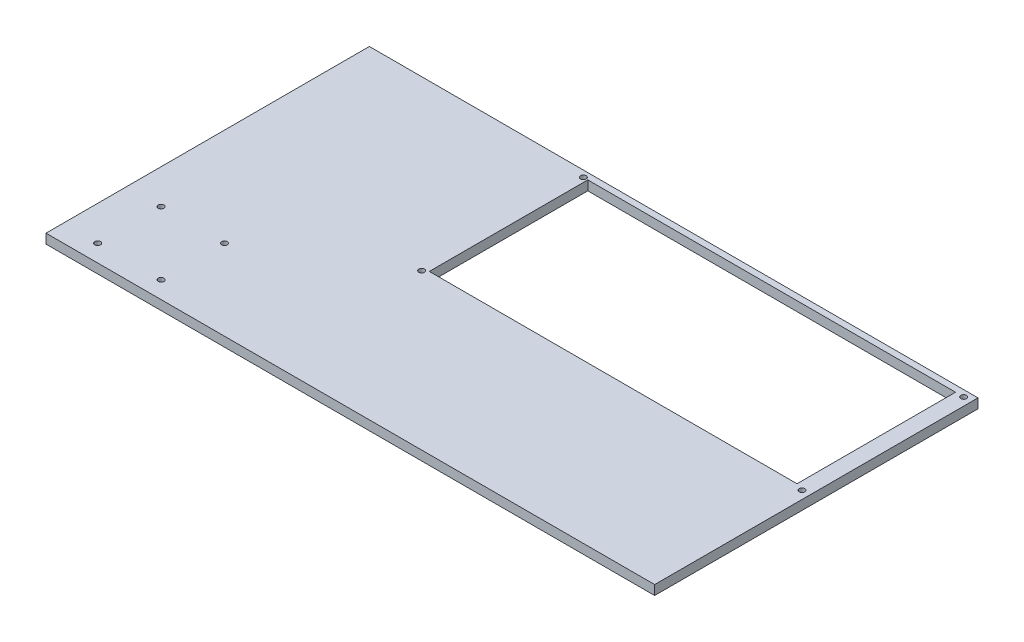
ISO-10303-21;
HEADER;
FILE_DESCRIPTION(('STEP AP214'),'2;1');
FILE_NAME('part.step','',(''),(''),'','','');
FILE_SCHEMA(('AUTOMOTIVE_DESIGN { 1 0 10303 214 1 1 1 1 }'));
ENDSEC;
DATA;
#1=APPLICATION_CONTEXT('core data for automotive mechanical design processes');
#2=APPLICATION_PROTOCOL_DEFINITION('international standard','automotive_design',2000,#1);
#3=PRODUCT_CONTEXT('',#1,'mechanical');
#4=PRODUCT('Part','Part','',(#3));
#5=PRODUCT_RELATED_PRODUCT_CATEGORY('part','',(#4));
#6=PRODUCT_DEFINITION_FORMATION('','',#4);
#7=PRODUCT_DEFINITION_CONTEXT('part definition',#1,'design');
#8=PRODUCT_DEFINITION('design','',#6,#7);
#9=PRODUCT_DEFINITION_SHAPE('','',#8);
#10=(LENGTH_UNIT() NAMED_UNIT(*) SI_UNIT(.MILLI.,.METRE.));
#11=(NAMED_UNIT(*) PLANE_ANGLE_UNIT() SI_UNIT($,.RADIAN.));
#12=(NAMED_UNIT(*) SI_UNIT($,.STERADIAN.) SOLID_ANGLE_UNIT());
#13=UNCERTAINTY_MEASURE_WITH_UNIT(LENGTH_MEASURE(1.E-05),#10,'distance_accuracy_value','');
#14=(GEOMETRIC_REPRESENTATION_CONTEXT(3) GLOBAL_UNCERTAINTY_ASSIGNED_CONTEXT((#13)) GLOBAL_UNIT_ASSIGNED_CONTEXT((#10,
#11,#12)) REPRESENTATION_CONTEXT('',''));
#15=CARTESIAN_POINT('',(0.,0.,0.));
#16=DIRECTION('',(0.,0.,1.));
#17=DIRECTION('',(1.,0.,0.));
#18=AXIS2_PLACEMENT_3D('',#15,#16,#17);
#19=CARTESIAN_POINT('',(-480.,7.50000000000006,255.));
#20=DIRECTION('',(1.,0.,0.));
#21=DIRECTION('',(0.,0.,-1.));
#22=AXIS2_PLACEMENT_3D('',#19,#20,#21);
#23=PLANE('',#22);
#24=DIRECTION('',(0.,0.,1.));
#25=VECTOR('',#24,1.);
#26=CARTESIAN_POINT('',(-480.,-7.49999999999995,255.));
#27=LINE('',#26,#25);
#28=CARTESIAN_POINT('',(-480.,-7.49999999999984,-255.));
#29=VERTEX_POINT('',#28);
#30=CARTESIAN_POINT('',(-480.,-7.49999999999995,255.));
#31=VERTEX_POINT('',#30);
#32=EDGE_CURVE('E135',#29,#31,#27,.T.);
#33=ORIENTED_EDGE('',*,*,#32,.T.);
#34=DIRECTION('',(0.,-1.,0.));
#35=VECTOR('',#34,1.);
#36=CARTESIAN_POINT('',(-480.,7.50000000000006,255.));
#37=LINE('',#36,#35);
#38=CARTESIAN_POINT('',(-480.,7.50000000000006,255.));
#39=VERTEX_POINT('',#38);
#40=EDGE_CURVE('E11',#39,#31,#37,.T.);
#41=ORIENTED_EDGE('',*,*,#40,.F.);
#42=DIRECTION('',(0.,0.,1.));
#43=VECTOR('',#42,1.);
#44=CARTESIAN_POINT('',(-480.,7.50000000000006,255.));
#45=LINE('',#44,#43);
#46=CARTESIAN_POINT('',(-480.,7.50000000000006,-255.));
#47=VERTEX_POINT('',#46);
#48=EDGE_CURVE('E139',#47,#39,#45,.T.);
#49=ORIENTED_EDGE('',*,*,#48,.F.);
#50=DIRECTION('',(0.,-1.,0.));
#51=VECTOR('',#50,1.);
#52=CARTESIAN_POINT('',(-480.,7.50000000000006,-255.));
#53=LINE('',#52,#51);
#54=EDGE_CURVE('E149',#47,#29,#53,.T.);
#55=ORIENTED_EDGE('',*,*,#54,.T.);
#56=EDGE_LOOP('',(#33,#41,#49,#55));
#57=FACE_BOUND('',#56,.T.);
#58=ADVANCED_FACE('F34',(#57),#23,.F.);
#59=CARTESIAN_POINT('',(480.,7.49999999999995,255.));
#60=DIRECTION('',(0.,0.,-1.));
#61=DIRECTION('',(-1.,0.,0.));
#62=AXIS2_PLACEMENT_3D('',#59,#60,#61);
#63=PLANE('',#62);
#64=DIRECTION('',(1.,0.,0.));
#65=VECTOR('',#64,1.);
#66=CARTESIAN_POINT('',(480.,-7.49999999999995,255.));
#67=LINE('',#66,#65);
#68=CARTESIAN_POINT('',(480.,-7.49999999999995,255.));
#69=VERTEX_POINT('',#68);
#70=EDGE_CURVE('E152',#31,#69,#67,.T.);
#71=ORIENTED_EDGE('',*,*,#70,.T.);
#72=DIRECTION('',(0.,-1.,0.));
#73=VECTOR('',#72,1.);
#74=CARTESIAN_POINT('',(480.,7.49999999999995,255.));
#75=LINE('',#74,#73);
#76=CARTESIAN_POINT('',(480.,7.49999999999995,255.));
#77=VERTEX_POINT('',#76);
#78=EDGE_CURVE('E41',#77,#69,#75,.T.);
#79=ORIENTED_EDGE('',*,*,#78,.F.);
#80=DIRECTION('',(1.,0.,0.));
#81=VECTOR('',#80,1.);
#82=CARTESIAN_POINT('',(480.,7.49999999999995,255.));
#83=LINE('',#82,#81);
#84=EDGE_CURVE('E142',#39,#77,#83,.T.);
#85=ORIENTED_EDGE('',*,*,#84,.F.);
#86=ORIENTED_EDGE('',*,*,#40,.T.);
#87=EDGE_LOOP('',(#71,#79,#85,#86));
#88=FACE_BOUND('',#87,.T.);
#89=ADVANCED_FACE('F180',(#88),#63,.F.);
#90=CARTESIAN_POINT('',(480.,7.49999999999995,255.));
#91=DIRECTION('',(-1.,0.,0.));
#92=DIRECTION('',(0.,0.,1.));
#93=AXIS2_PLACEMENT_3D('',#90,#91,#92);
#94=PLANE('',#93);
#95=DIRECTION('',(0.,0.,-1.));
#96=VECTOR('',#95,1.);
#97=CARTESIAN_POINT('',(480.,-7.49999999999995,255.));
#98=LINE('',#97,#96);
#99=CARTESIAN_POINT('',(480.,-7.49999999999995,-255.));
#100=VERTEX_POINT('',#99);
#101=EDGE_CURVE('E154',#69,#100,#98,.T.);
#102=ORIENTED_EDGE('',*,*,#101,.T.);
#103=DIRECTION('',(0.,-1.,0.));
#104=VECTOR('',#103,1.);
#105=CARTESIAN_POINT('',(480.,7.50000000000006,-255.));
#106=LINE('',#105,#104);
#107=CARTESIAN_POINT('',(480.,7.50000000000006,-255.));
#108=VERTEX_POINT('',#107);
#109=EDGE_CURVE('E159',#108,#100,#106,.T.);
#110=ORIENTED_EDGE('',*,*,#109,.F.);
#111=DIRECTION('',(0.,0.,-1.));
#112=VECTOR('',#111,1.);
#113=CARTESIAN_POINT('',(480.,7.49999999999995,255.));
#114=LINE('',#113,#112);
#115=EDGE_CURVE('E145',#77,#108,#114,.T.);
#116=ORIENTED_EDGE('',*,*,#115,.F.);
#117=ORIENTED_EDGE('',*,*,#78,.T.);
#118=EDGE_LOOP('',(#102,#110,#116,#117));
#119=FACE_BOUND('',#118,.T.);
#120=ADVANCED_FACE('F166',(#119),#94,.F.);
#121=CARTESIAN_POINT('',(480.,7.50000000000006,-255.));
#122=DIRECTION('',(0.,0.,1.));
#123=DIRECTION('',(1.,0.,0.));
#124=AXIS2_PLACEMENT_3D('',#121,#122,#123);
#125=PLANE('',#124);
#126=DIRECTION('',(-1.,0.,0.));
#127=VECTOR('',#126,1.);
#128=CARTESIAN_POINT('',(480.,-7.49999999999995,-255.));
#129=LINE('',#128,#127);
#130=EDGE_CURVE('E143',#100,#29,#129,.T.);
#131=ORIENTED_EDGE('',*,*,#130,.T.);
#132=ORIENTED_EDGE('',*,*,#54,.F.);
#133=DIRECTION('',(-1.,0.,0.));
#134=VECTOR('',#133,1.);
#135=CARTESIAN_POINT('',(480.,7.50000000000006,-255.));
#136=LINE('',#135,#134);
#137=EDGE_CURVE('E147',#108,#47,#136,.T.);
#138=ORIENTED_EDGE('',*,*,#137,.F.);
#139=ORIENTED_EDGE('',*,*,#109,.T.);
#140=EDGE_LOOP('',(#131,#132,#138,#139));
#141=FACE_BOUND('',#140,.T.);
#142=ADVANCED_FACE('F173',(#141),#125,.F.);
#143=CARTESIAN_POINT('',(0.,7.49999999999995,0.));
#144=DIRECTION('',(0.,1.,0.));
#145=DIRECTION('',(0.,0.,1.));
#146=AXIS2_PLACEMENT_3D('',#143,#144,#145);
#147=PLANE('',#146);
#148=CARTESIAN_POINT('',(-132.5,7.49999999999995,10.0000000000007));
#149=DIRECTION('',(0.,-1.,0.));
#150=DIRECTION('',(0.,0.,-1.));
#151=AXIS2_PLACEMENT_3D('',#148,#149,#150);
#152=CIRCLE('',#151,4.49999999999999);
#153=CARTESIAN_POINT('',(-132.5,7.49999999999995,5.50000000000068));
#154=VERTEX_POINT('',#153);
#155=EDGE_CURVE('E271',#154,#154,#152,.T.);
#156=ORIENTED_EDGE('',*,*,#155,.T.);
#157=EDGE_LOOP('',(#156));
#158=FACE_BOUND('',#157,.T.);
#159=CARTESIAN_POINT('',(-325.5,7.50000000000006,228.));
#160=DIRECTION('',(0.,-1.,0.));
#161=DIRECTION('',(0.,0.,-1.));
#162=AXIS2_PLACEMENT_3D('',#159,#160,#161);
#163=CIRCLE('',#162,4.50000000000002);
#164=CARTESIAN_POINT('',(-325.5,7.50000000000006,223.5));
#165=VERTEX_POINT('',#164);
#166=EDGE_CURVE('E264',#165,#165,#163,.T.);
#167=ORIENTED_EDGE('',*,*,#166,.T.);
#168=EDGE_LOOP('',(#167));
#169=FACE_BOUND('',#168,.T.);
#170=CARTESIAN_POINT('',(-325.5,7.49999999999995,128.));
#171=DIRECTION('',(0.,-1.,0.));
#172=DIRECTION('',(0.,0.,-1.));
#173=AXIS2_PLACEMENT_3D('',#170,#171,#172);
#174=CIRCLE('',#173,4.50000000000002);
#175=CARTESIAN_POINT('',(-325.5,7.49999999999995,123.5));
#176=VERTEX_POINT('',#175);
#177=EDGE_CURVE('E282',#176,#176,#174,.T.);
#178=ORIENTED_EDGE('',*,*,#177,.T.);
#179=EDGE_LOOP('',(#178));
#180=FACE_BOUND('',#179,.T.);
#181=CARTESIAN_POINT('',(-425.5,7.50000000000006,128.));
#182=DIRECTION('',(0.,-1.,0.));
#183=DIRECTION('',(0.,0.,-1.));
#184=AXIS2_PLACEMENT_3D('',#181,#182,#183);
#185=CIRCLE('',#184,4.50000000000002);
#186=CARTESIAN_POINT('',(-425.5,7.50000000000006,123.5));
#187=VERTEX_POINT('',#186);
#188=EDGE_CURVE('E276',#187,#187,#185,.T.);
#189=ORIENTED_EDGE('',*,*,#188,.T.);
#190=EDGE_LOOP('',(#189));
#191=FACE_BOUND('',#190,.T.);
#192=CARTESIAN_POINT('',(-132.5,7.49999999999995,-244.999999999999));
#193=DIRECTION('',(0.,-1.,0.));
#194=DIRECTION('',(0.,0.,-1.));
#195=AXIS2_PLACEMENT_3D('',#192,#193,#194);
#196=CIRCLE('',#195,4.50000000000004);
#197=CARTESIAN_POINT('',(-132.5,7.49999999999995,-249.499999999999));
#198=VERTEX_POINT('',#197);
#199=EDGE_CURVE('E243',#198,#198,#196,.T.);
#200=ORIENTED_EDGE('',*,*,#199,.T.);
#201=EDGE_LOOP('',(#200));
#202=FACE_BOUND('',#201,.T.);
#203=CARTESIAN_POINT('',(467.5,7.49999999999995,-244.999999999999));
#204=DIRECTION('',(0.,-1.,0.));
#205=DIRECTION('',(0.,0.,-1.));
#206=AXIS2_PLACEMENT_3D('',#203,#204,#205);
#207=CIRCLE('',#206,4.50000000000002);
#208=CARTESIAN_POINT('',(467.5,7.49999999999995,-249.499999999999));
#209=VERTEX_POINT('',#208);
#210=EDGE_CURVE('E248',#209,#209,#207,.T.);
#211=ORIENTED_EDGE('',*,*,#210,.T.);
#212=EDGE_LOOP('',(#211));
#213=FACE_BOUND('',#212,.T.);
#214=CARTESIAN_POINT('',(467.5,7.49999999999995,10.0000000000007));
#215=DIRECTION('',(0.,-1.,0.));
#216=DIRECTION('',(0.,0.,-1.));
#217=AXIS2_PLACEMENT_3D('',#214,#215,#216);
#218=CIRCLE('',#217,4.49999999999999);
#219=CARTESIAN_POINT('',(467.5,7.49999999999995,5.50000000000072));
#220=VERTEX_POINT('',#219);
#221=EDGE_CURVE('E258',#220,#220,#218,.T.);
#222=ORIENTED_EDGE('',*,*,#221,.T.);
#223=EDGE_LOOP('',(#222));
#224=FACE_BOUND('',#223,.T.);
#225=CARTESIAN_POINT('',(-425.5,7.50000000000006,228.));
#226=DIRECTION('',(0.,-1.,0.));
#227=DIRECTION('',(0.,0.,-1.));
#228=AXIS2_PLACEMENT_3D('',#225,#226,#227);
#229=CIRCLE('',#228,4.50000000000004);
#230=CARTESIAN_POINT('',(-425.5,7.50000000000006,223.5));
#231=VERTEX_POINT('',#230);
#232=EDGE_CURVE('E129',#231,#231,#229,.T.);
#233=ORIENTED_EDGE('',*,*,#232,.T.);
#234=EDGE_LOOP('',(#233));
#235=FACE_BOUND('',#234,.T.);
#236=DIRECTION('',(0.,0.,-1.));
#237=VECTOR('',#236,1.);
#238=CARTESIAN_POINT('',(454.54751,7.49999999999995,-245.));
#239=LINE('',#238,#237);
#240=CARTESIAN_POINT('',(454.54751,7.49999999999995,4.99999999999992));
#241=VERTEX_POINT('',#240);
#242=CARTESIAN_POINT('',(454.54751,7.49999999999995,-245.));
#243=VERTEX_POINT('',#242);
#244=EDGE_CURVE('E48',#241,#243,#239,.T.);
#245=ORIENTED_EDGE('',*,*,#244,.F.);
#246=DIRECTION('',(1.,0.,0.));
#247=VECTOR('',#246,1.);
#248=CARTESIAN_POINT('',(454.54751,7.49999999999995,4.99999999999992));
#249=LINE('',#248,#247);
#250=CARTESIAN_POINT('',(-125.45249,7.49999999999995,5.));
#251=VERTEX_POINT('',#250);
#252=EDGE_CURVE('E116',#251,#241,#249,.T.);
#253=ORIENTED_EDGE('',*,*,#252,.F.);
#254=DIRECTION('',(0.,0.,1.));
#255=VECTOR('',#254,1.);
#256=CARTESIAN_POINT('',(-125.45249,7.49999999999995,-245.));
#257=LINE('',#256,#255);
#258=CARTESIAN_POINT('',(-125.45249,7.49999999999995,-245.));
#259=VERTEX_POINT('',#258);
#260=EDGE_CURVE('E119',#259,#251,#257,.T.);
#261=ORIENTED_EDGE('',*,*,#260,.F.);
#262=DIRECTION('',(-1.,0.,0.));
#263=VECTOR('',#262,1.);
#264=CARTESIAN_POINT('',(454.54751,7.49999999999995,-245.));
#265=LINE('',#264,#263);
#266=EDGE_CURVE('E128',#243,#259,#265,.T.);
#267=ORIENTED_EDGE('',*,*,#266,.F.);
#268=EDGE_LOOP('',(#245,#253,#261,#267));
#269=FACE_BOUND('',#268,.T.);
#270=ORIENTED_EDGE('',*,*,#48,.T.);
#271=ORIENTED_EDGE('',*,*,#84,.T.);
#272=ORIENTED_EDGE('',*,*,#115,.T.);
#273=ORIENTED_EDGE('',*,*,#137,.T.);
#274=EDGE_LOOP('',(#270,#271,#272,#273));
#275=FACE_BOUND('',#274,.T.);
#276=ADVANCED_FACE('F179',(#158,#169,#180,#191,#202,#213,#224,#235,#269,#275),#147,.T.);
#277=CARTESIAN_POINT('',(0.,-7.49999999999995,0.));
#278=DIRECTION('',(0.,1.,0.));
#279=DIRECTION('',(0.,0.,1.));
#280=AXIS2_PLACEMENT_3D('',#277,#278,#279);
#281=PLANE('',#280);
#282=CARTESIAN_POINT('',(-132.5,-7.50000000000006,10.0000000000007));
#283=DIRECTION('',(0.,-1.,0.));
#284=DIRECTION('',(0.,0.,-1.));
#285=AXIS2_PLACEMENT_3D('',#282,#283,#284);
#286=CIRCLE('',#285,4.49999999999999);
#287=CARTESIAN_POINT('',(-132.5,-7.50000000000006,5.50000000000068));
#288=VERTEX_POINT('',#287);
#289=EDGE_CURVE('E250',#288,#288,#286,.T.);
#290=ORIENTED_EDGE('',*,*,#289,.F.);
#291=EDGE_LOOP('',(#290));
#292=FACE_BOUND('',#291,.T.);
#293=CARTESIAN_POINT('',(-325.5,-7.49999999999995,228.));
#294=DIRECTION('',(0.,-1.,0.));
#295=DIRECTION('',(0.,0.,-1.));
#296=AXIS2_PLACEMENT_3D('',#293,#294,#295);
#297=CIRCLE('',#296,4.50000000000002);
#298=CARTESIAN_POINT('',(-325.5,-7.49999999999995,223.5));
#299=VERTEX_POINT('',#298);
#300=EDGE_CURVE('E268',#299,#299,#297,.T.);
#301=ORIENTED_EDGE('',*,*,#300,.F.);
#302=EDGE_LOOP('',(#301));
#303=FACE_BOUND('',#302,.T.);
#304=CARTESIAN_POINT('',(-325.5,-7.49999999999995,128.));
#305=DIRECTION('',(0.,-1.,0.));
#306=DIRECTION('',(0.,0.,-1.));
#307=AXIS2_PLACEMENT_3D('',#304,#305,#306);
#308=CIRCLE('',#307,4.50000000000002);
#309=CARTESIAN_POINT('',(-325.5,-7.49999999999995,123.5));
#310=VERTEX_POINT('',#309);
#311=EDGE_CURVE('E267',#310,#310,#308,.T.);
#312=ORIENTED_EDGE('',*,*,#311,.F.);
#313=EDGE_LOOP('',(#312));
#314=FACE_BOUND('',#313,.T.);
#315=CARTESIAN_POINT('',(-425.5,-7.49999999999995,128.));
#316=DIRECTION('',(0.,-1.,0.));
#317=DIRECTION('',(0.,0.,-1.));
#318=AXIS2_PLACEMENT_3D('',#315,#316,#317);
#319=CIRCLE('',#318,4.50000000000002);
#320=CARTESIAN_POINT('',(-425.5,-7.49999999999995,123.5));
#321=VERTEX_POINT('',#320);
#322=EDGE_CURVE('E279',#321,#321,#319,.T.);
#323=ORIENTED_EDGE('',*,*,#322,.F.);
#324=EDGE_LOOP('',(#323));
#325=FACE_BOUND('',#324,.T.);
#326=CARTESIAN_POINT('',(-132.5,-7.50000000000006,-244.999999999999));
#327=DIRECTION('',(0.,-1.,0.));
#328=DIRECTION('',(0.,0.,-1.));
#329=AXIS2_PLACEMENT_3D('',#326,#327,#328);
#330=CIRCLE('',#329,4.50000000000004);
#331=CARTESIAN_POINT('',(-132.5,-7.50000000000006,-249.499999999999));
#332=VERTEX_POINT('',#331);
#333=EDGE_CURVE('E246',#332,#332,#330,.T.);
#334=ORIENTED_EDGE('',*,*,#333,.F.);
#335=EDGE_LOOP('',(#334));
#336=FACE_BOUND('',#335,.T.);
#337=CARTESIAN_POINT('',(467.5,-7.50000000000006,-244.999999999999));
#338=DIRECTION('',(0.,-1.,0.));
#339=DIRECTION('',(0.,0.,-1.));
#340=AXIS2_PLACEMENT_3D('',#337,#338,#339);
#341=CIRCLE('',#340,4.50000000000002);
#342=CARTESIAN_POINT('',(467.5,-7.50000000000006,-249.499999999999));
#343=VERTEX_POINT('',#342);
#344=EDGE_CURVE('E253',#343,#343,#341,.T.);
#345=ORIENTED_EDGE('',*,*,#344,.F.);
#346=EDGE_LOOP('',(#345));
#347=FACE_BOUND('',#346,.T.);
#348=CARTESIAN_POINT('',(467.5,-7.50000000000006,10.0000000000007));
#349=DIRECTION('',(0.,-1.,0.));
#350=DIRECTION('',(0.,0.,-1.));
#351=AXIS2_PLACEMENT_3D('',#348,#349,#350);
#352=CIRCLE('',#351,4.49999999999999);
#353=CARTESIAN_POINT('',(467.5,-7.50000000000006,5.50000000000072));
#354=VERTEX_POINT('',#353);
#355=EDGE_CURVE('E261',#354,#354,#352,.T.);
#356=ORIENTED_EDGE('',*,*,#355,.F.);
#357=EDGE_LOOP('',(#356));
#358=FACE_BOUND('',#357,.T.);
#359=CARTESIAN_POINT('',(-425.5,-7.49999999999995,228.));
#360=DIRECTION('',(0.,-1.,0.));
#361=DIRECTION('',(0.,0.,-1.));
#362=AXIS2_PLACEMENT_3D('',#359,#360,#361);
#363=CIRCLE('',#362,4.50000000000004);
#364=CARTESIAN_POINT('',(-425.5,-7.49999999999995,223.5));
#365=VERTEX_POINT('',#364);
#366=EDGE_CURVE('E122',#365,#365,#363,.T.);
#367=ORIENTED_EDGE('',*,*,#366,.F.);
#368=EDGE_LOOP('',(#367));
#369=FACE_BOUND('',#368,.T.);
#370=DIRECTION('',(1.,0.,0.));
#371=VECTOR('',#370,1.);
#372=CARTESIAN_POINT('',(454.54751,-7.50000000000006,4.99999999999992));
#373=LINE('',#372,#371);
#374=CARTESIAN_POINT('',(-125.45249,-7.50000000000006,5.));
#375=VERTEX_POINT('',#374);
#376=CARTESIAN_POINT('',(454.54751,-7.50000000000006,4.99999999999992));
#377=VERTEX_POINT('',#376);
#378=EDGE_CURVE('E106',#375,#377,#373,.T.);
#379=ORIENTED_EDGE('',*,*,#378,.T.);
#380=DIRECTION('',(0.,0.,-1.));
#381=VECTOR('',#380,1.);
#382=CARTESIAN_POINT('',(454.54751,-7.50000000000006,-245.));
#383=LINE('',#382,#381);
#384=CARTESIAN_POINT('',(454.54751,-7.50000000000006,-245.));
#385=VERTEX_POINT('',#384);
#386=EDGE_CURVE('E100',#377,#385,#383,.T.);
#387=ORIENTED_EDGE('',*,*,#386,.T.);
#388=DIRECTION('',(-1.,0.,0.));
#389=VECTOR('',#388,1.);
#390=CARTESIAN_POINT('',(454.54751,-7.50000000000006,-245.));
#391=LINE('',#390,#389);
#392=CARTESIAN_POINT('',(-125.45249,-7.50000000000006,-245.));
#393=VERTEX_POINT('',#392);
#394=EDGE_CURVE('E109',#385,#393,#391,.T.);
#395=ORIENTED_EDGE('',*,*,#394,.T.);
#396=DIRECTION('',(0.,0.,1.));
#397=VECTOR('',#396,1.);
#398=CARTESIAN_POINT('',(-125.45249,-7.50000000000006,-245.));
#399=LINE('',#398,#397);
#400=EDGE_CURVE('E56',#393,#375,#399,.T.);
#401=ORIENTED_EDGE('',*,*,#400,.T.);
#402=EDGE_LOOP('',(#379,#387,#395,#401));
#403=FACE_BOUND('',#402,.T.);
#404=ORIENTED_EDGE('',*,*,#32,.F.);
#405=ORIENTED_EDGE('',*,*,#130,.F.);
#406=ORIENTED_EDGE('',*,*,#101,.F.);
#407=ORIENTED_EDGE('',*,*,#70,.F.);
#408=EDGE_LOOP('',(#404,#405,#406,#407));
#409=FACE_BOUND('',#408,.T.);
#410=ADVANCED_FACE('F113',(#292,#303,#314,#325,#336,#347,#358,#369,#403,#409),#281,.F.);
#411=CARTESIAN_POINT('',(454.54751,-7.50000000000006,-245.));
#412=DIRECTION('',(1.,0.,0.));
#413=DIRECTION('',(0.,0.,-1.));
#414=AXIS2_PLACEMENT_3D('',#411,#412,#413);
#415=PLANE('',#414);
#416=ORIENTED_EDGE('',*,*,#244,.T.);
#417=DIRECTION('',(0.,1.,0.));
#418=VECTOR('',#417,1.);
#419=CARTESIAN_POINT('',(454.54751,-7.50000000000006,-245.));
#420=LINE('',#419,#418);
#421=EDGE_CURVE('E96',#385,#243,#420,.T.);
#422=ORIENTED_EDGE('',*,*,#421,.F.);
#423=ORIENTED_EDGE('',*,*,#386,.F.);
#424=DIRECTION('',(0.,1.,0.));
#425=VECTOR('',#424,1.);
#426=CARTESIAN_POINT('',(454.54751,-7.50000000000006,4.99999999999992));
#427=LINE('',#426,#425);
#428=EDGE_CURVE('E133',#377,#241,#427,.T.);
#429=ORIENTED_EDGE('',*,*,#428,.T.);
#430=EDGE_LOOP('',(#416,#422,#423,#429));
#431=FACE_BOUND('',#430,.T.);
#432=ADVANCED_FACE('F98',(#431),#415,.F.);
#433=CARTESIAN_POINT('',(454.54751,-7.50000000000006,4.99999999999992));
#434=DIRECTION('',(0.,0.,1.));
#435=DIRECTION('',(1.,0.,0.));
#436=AXIS2_PLACEMENT_3D('',#433,#434,#435);
#437=PLANE('',#436);
#438=ORIENTED_EDGE('',*,*,#252,.T.);
#439=ORIENTED_EDGE('',*,*,#428,.F.);
#440=ORIENTED_EDGE('',*,*,#378,.F.);
#441=DIRECTION('',(0.,1.,0.));
#442=VECTOR('',#441,1.);
#443=CARTESIAN_POINT('',(-125.45249,-7.50000000000006,5.));
#444=LINE('',#443,#442);
#445=EDGE_CURVE('E136',#375,#251,#444,.T.);
#446=ORIENTED_EDGE('',*,*,#445,.T.);
#447=EDGE_LOOP('',(#438,#439,#440,#446));
#448=FACE_BOUND('',#447,.T.);
#449=ADVANCED_FACE('F198',(#448),#437,.F.);
#450=CARTESIAN_POINT('',(-125.45249,-7.50000000000006,-245.));
#451=DIRECTION('',(-1.,0.,0.));
#452=DIRECTION('',(0.,0.,1.));
#453=AXIS2_PLACEMENT_3D('',#450,#451,#452);
#454=PLANE('',#453);
#455=ORIENTED_EDGE('',*,*,#260,.T.);
#456=ORIENTED_EDGE('',*,*,#445,.F.);
#457=ORIENTED_EDGE('',*,*,#400,.F.);
#458=DIRECTION('',(0.,1.,0.));
#459=VECTOR('',#458,1.);
#460=CARTESIAN_POINT('',(-125.45249,-7.50000000000006,-245.));
#461=LINE('',#460,#459);
#462=EDGE_CURVE('E105',#393,#259,#461,.T.);
#463=ORIENTED_EDGE('',*,*,#462,.T.);
#464=EDGE_LOOP('',(#455,#456,#457,#463));
#465=FACE_BOUND('',#464,.T.);
#466=ADVANCED_FACE('F202',(#465),#454,.F.);
#467=CARTESIAN_POINT('',(454.54751,-7.50000000000006,-245.));
#468=DIRECTION('',(0.,0.,-1.));
#469=DIRECTION('',(-1.,0.,0.));
#470=AXIS2_PLACEMENT_3D('',#467,#468,#469);
#471=PLANE('',#470);
#472=ORIENTED_EDGE('',*,*,#266,.T.);
#473=ORIENTED_EDGE('',*,*,#462,.F.);
#474=ORIENTED_EDGE('',*,*,#394,.F.);
#475=ORIENTED_EDGE('',*,*,#421,.T.);
#476=EDGE_LOOP('',(#472,#473,#474,#475));
#477=FACE_BOUND('',#476,.T.);
#478=ADVANCED_FACE('F110',(#477),#471,.F.);
#479=CARTESIAN_POINT('',(-425.5,7.50000000000006,228.));
#480=DIRECTION('',(0.,-1.,0.));
#481=DIRECTION('',(0.,0.,-1.));
#482=AXIS2_PLACEMENT_3D('',#479,#480,#481);
#483=CYLINDRICAL_SURFACE('',#482,4.50000000000004);
#484=ORIENTED_EDGE('',*,*,#232,.F.);
#485=EDGE_LOOP('',(#484));
#486=FACE_BOUND('',#485,.T.);
#487=ORIENTED_EDGE('',*,*,#366,.T.);
#488=EDGE_LOOP('',(#487));
#489=FACE_BOUND('',#488,.T.);
#490=ADVANCED_FACE('F201',(#486,#489),#483,.F.);
#491=CARTESIAN_POINT('',(467.5,7.49999999999995,10.0000000000007));
#492=DIRECTION('',(0.,-1.,0.));
#493=DIRECTION('',(0.,0.,-1.));
#494=AXIS2_PLACEMENT_3D('',#491,#492,#493);
#495=CYLINDRICAL_SURFACE('',#494,4.49999999999999);
#496=ORIENTED_EDGE('',*,*,#221,.F.);
#497=EDGE_LOOP('',(#496));
#498=FACE_BOUND('',#497,.T.);
#499=ORIENTED_EDGE('',*,*,#355,.T.);
#500=EDGE_LOOP('',(#499));
#501=FACE_BOUND('',#500,.T.);
#502=ADVANCED_FACE('F210',(#498,#501),#495,.F.);
#503=CARTESIAN_POINT('',(467.5,7.49999999999995,-244.999999999999));
#504=DIRECTION('',(0.,-1.,0.));
#505=DIRECTION('',(0.,0.,-1.));
#506=AXIS2_PLACEMENT_3D('',#503,#504,#505);
#507=CYLINDRICAL_SURFACE('',#506,4.50000000000002);
#508=ORIENTED_EDGE('',*,*,#210,.F.);
#509=EDGE_LOOP('',(#508));
#510=FACE_BOUND('',#509,.T.);
#511=ORIENTED_EDGE('',*,*,#344,.T.);
#512=EDGE_LOOP('',(#511));
#513=FACE_BOUND('',#512,.T.);
#514=ADVANCED_FACE('F231',(#510,#513),#507,.F.);
#515=CARTESIAN_POINT('',(-132.5,7.49999999999995,-244.999999999999));
#516=DIRECTION('',(0.,-1.,0.));
#517=DIRECTION('',(0.,0.,-1.));
#518=AXIS2_PLACEMENT_3D('',#515,#516,#517);
#519=CYLINDRICAL_SURFACE('',#518,4.50000000000004);
#520=ORIENTED_EDGE('',*,*,#199,.F.);
#521=EDGE_LOOP('',(#520));
#522=FACE_BOUND('',#521,.T.);
#523=ORIENTED_EDGE('',*,*,#333,.T.);
#524=EDGE_LOOP('',(#523));
#525=FACE_BOUND('',#524,.T.);
#526=ADVANCED_FACE('F220',(#522,#525),#519,.F.);
#527=CARTESIAN_POINT('',(-425.5,7.50000000000006,128.));
#528=DIRECTION('',(0.,-1.,0.));
#529=DIRECTION('',(0.,0.,-1.));
#530=AXIS2_PLACEMENT_3D('',#527,#528,#529);
#531=CYLINDRICAL_SURFACE('',#530,4.50000000000002);
#532=ORIENTED_EDGE('',*,*,#188,.F.);
#533=EDGE_LOOP('',(#532));
#534=FACE_BOUND('',#533,.T.);
#535=ORIENTED_EDGE('',*,*,#322,.T.);
#536=EDGE_LOOP('',(#535));
#537=FACE_BOUND('',#536,.T.);
#538=ADVANCED_FACE('F216',(#534,#537),#531,.F.);
#539=CARTESIAN_POINT('',(-325.5,7.49999999999995,128.));
#540=DIRECTION('',(0.,-1.,0.));
#541=DIRECTION('',(0.,0.,-1.));
#542=AXIS2_PLACEMENT_3D('',#539,#540,#541);
#543=CYLINDRICAL_SURFACE('',#542,4.50000000000002);
#544=ORIENTED_EDGE('',*,*,#177,.F.);
#545=EDGE_LOOP('',(#544));
#546=FACE_BOUND('',#545,.T.);
#547=ORIENTED_EDGE('',*,*,#311,.T.);
#548=EDGE_LOOP('',(#547));
#549=FACE_BOUND('',#548,.T.);
#550=ADVANCED_FACE('F212',(#546,#549),#543,.F.);
#551=CARTESIAN_POINT('',(-325.5,7.50000000000006,228.));
#552=DIRECTION('',(0.,-1.,0.));
#553=DIRECTION('',(0.,0.,-1.));
#554=AXIS2_PLACEMENT_3D('',#551,#552,#553);
#555=CYLINDRICAL_SURFACE('',#554,4.50000000000002);
#556=ORIENTED_EDGE('',*,*,#166,.F.);
#557=EDGE_LOOP('',(#556));
#558=FACE_BOUND('',#557,.T.);
#559=ORIENTED_EDGE('',*,*,#300,.T.);
#560=EDGE_LOOP('',(#559));
#561=FACE_BOUND('',#560,.T.);
#562=ADVANCED_FACE('F215',(#558,#561),#555,.F.);
#563=CARTESIAN_POINT('',(-132.5,7.49999999999995,10.0000000000007));
#564=DIRECTION('',(0.,-1.,0.));
#565=DIRECTION('',(0.,0.,-1.));
#566=AXIS2_PLACEMENT_3D('',#563,#564,#565);
#567=CYLINDRICAL_SURFACE('',#566,4.49999999999999);
#568=ORIENTED_EDGE('',*,*,#155,.F.);
#569=EDGE_LOOP('',(#568));
#570=FACE_BOUND('',#569,.T.);
#571=ORIENTED_EDGE('',*,*,#289,.T.);
#572=EDGE_LOOP('',(#571));
#573=FACE_BOUND('',#572,.T.);
#574=ADVANCED_FACE('F222',(#570,#573),#567,.F.);
#575=CLOSED_SHELL('',(#58,#89,#120,#142,#276,#410,#432,#449,#466,#478,#490,#502,#514,#526,#538,
#550,#562,#574));
#576=MANIFOLD_SOLID_BREP('B2',#575);
#577=ADVANCED_BREP_SHAPE_REPRESENTATION('',(#18,#576),#14);
#578=SHAPE_DEFINITION_REPRESENTATION(#9,#577);
ENDSEC;
END-ISO-10303-21;
